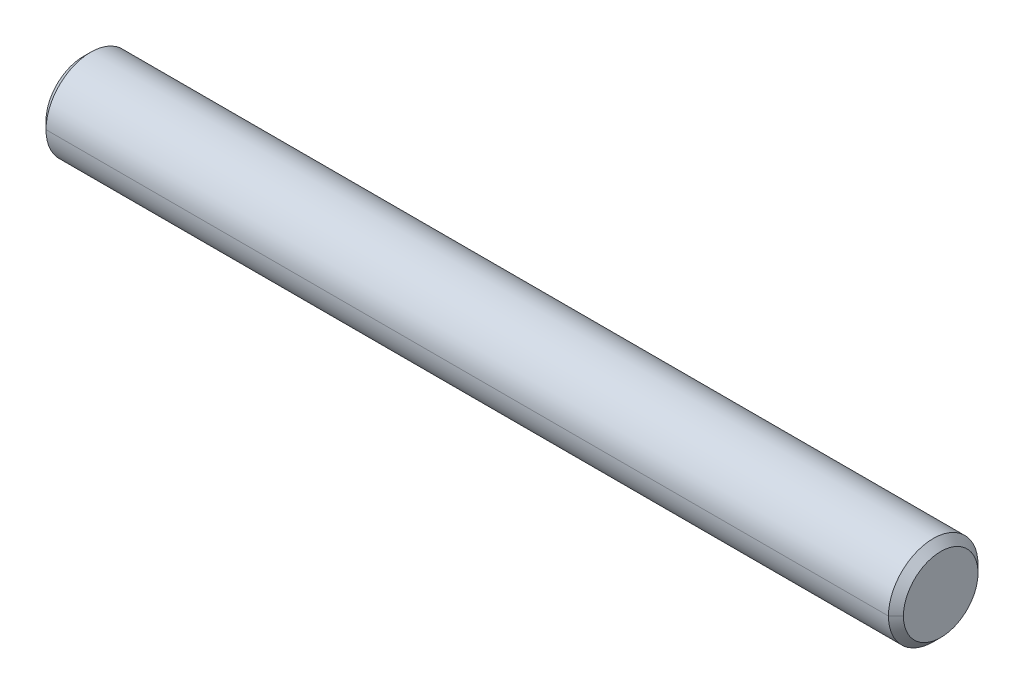
ISO-10303-21;
HEADER;
FILE_DESCRIPTION(('STEP AP214'),'2;1');
FILE_NAME('part.step','',(''),(''),'','','');
FILE_SCHEMA(('AUTOMOTIVE_DESIGN { 1 0 10303 214 1 1 1 1 }'));
ENDSEC;
DATA;
#1=APPLICATION_CONTEXT('core data for automotive mechanical design processes');
#2=APPLICATION_PROTOCOL_DEFINITION('international standard','automotive_design',2000,#1);
#3=PRODUCT_CONTEXT('',#1,'mechanical');
#4=PRODUCT('Part','Part','',(#3));
#5=PRODUCT_RELATED_PRODUCT_CATEGORY('part','',(#4));
#6=PRODUCT_DEFINITION_FORMATION('','',#4);
#7=PRODUCT_DEFINITION_CONTEXT('part definition',#1,'design');
#8=PRODUCT_DEFINITION('design','',#6,#7);
#9=PRODUCT_DEFINITION_SHAPE('','',#8);
#10=(LENGTH_UNIT() NAMED_UNIT(*) SI_UNIT(.MILLI.,.METRE.));
#11=(NAMED_UNIT(*) PLANE_ANGLE_UNIT() SI_UNIT($,.RADIAN.));
#12=(NAMED_UNIT(*) SI_UNIT($,.STERADIAN.) SOLID_ANGLE_UNIT());
#13=UNCERTAINTY_MEASURE_WITH_UNIT(LENGTH_MEASURE(1.E-05),#10,'distance_accuracy_value','');
#14=(GEOMETRIC_REPRESENTATION_CONTEXT(3) GLOBAL_UNCERTAINTY_ASSIGNED_CONTEXT((#13)) GLOBAL_UNIT_ASSIGNED_CONTEXT((#10,
#11,#12)) REPRESENTATION_CONTEXT('',''));
#15=CARTESIAN_POINT('',(0.,0.,0.));
#16=DIRECTION('',(0.,0.,1.));
#17=DIRECTION('',(1.,0.,0.));
#18=AXIS2_PLACEMENT_3D('',#15,#16,#17);
#19=CARTESIAN_POINT('',(28.575,0.,0.));
#20=DIRECTION('',(-1.,0.,0.));
#21=DIRECTION('',(0.,0.,1.));
#22=AXIS2_PLACEMENT_3D('',#19,#20,#21);
#23=CONICAL_SURFACE('',#22,2.4845,0.785398163397443);
#24=DIRECTION('',(-0.707106781186551,0.,-0.707106781186544));
#25=VECTOR('',#24,1.);
#26=CARTESIAN_POINT('',(28.575,0.,-2.4845));
#27=LINE('',#26,#25);
#28=CARTESIAN_POINT('',(28.575,0.,-2.4845));
#29=VERTEX_POINT('',#28);
#30=CARTESIAN_POINT('',(28.075,0.,-2.9845));
#31=VERTEX_POINT('',#30);
#32=EDGE_CURVE('E84',#29,#31,#27,.T.);
#33=ORIENTED_EDGE('',*,*,#32,.F.);
#34=CARTESIAN_POINT('',(28.575,0.,0.));
#35=DIRECTION('',(1.,0.,0.));
#36=DIRECTION('',(0.,0.,-1.));
#37=AXIS2_PLACEMENT_3D('',#34,#35,#36);
#38=CIRCLE('',#37,2.4845);
#39=CARTESIAN_POINT('',(28.575,0.,2.4845));
#40=VERTEX_POINT('',#39);
#41=EDGE_CURVE('E27',#40,#29,#38,.T.);
#42=ORIENTED_EDGE('',*,*,#41,.F.);
#43=DIRECTION('',(-0.707106781186551,0.,0.707106781186544));
#44=VECTOR('',#43,1.);
#45=CARTESIAN_POINT('',(28.575,0.,2.4845));
#46=LINE('',#45,#44);
#47=CARTESIAN_POINT('',(28.075,0.,2.9845));
#48=VERTEX_POINT('',#47);
#49=EDGE_CURVE('E91',#40,#48,#46,.T.);
#50=ORIENTED_EDGE('',*,*,#49,.T.);
#51=CARTESIAN_POINT('',(28.075,0.,0.));
#52=DIRECTION('',(-1.,0.,0.));
#53=DIRECTION('',(0.,0.,-1.));
#54=AXIS2_PLACEMENT_3D('',#51,#52,#53);
#55=CIRCLE('',#54,2.9845);
#56=EDGE_CURVE('E63',#31,#48,#55,.T.);
#57=ORIENTED_EDGE('',*,*,#56,.F.);
#58=EDGE_LOOP('',(#33,#42,#50,#57));
#59=FACE_BOUND('',#58,.T.);
#60=ADVANCED_FACE('F16',(#59),#23,.T.);
#61=CARTESIAN_POINT('',(-28.075,0.,0.));
#62=DIRECTION('',(1.,0.,0.));
#63=DIRECTION('',(0.,0.,-1.));
#64=AXIS2_PLACEMENT_3D('',#61,#62,#63);
#65=CONICAL_SURFACE('',#64,2.9845,0.78539816339746);
#66=DIRECTION('',(0.707106781186539,0.,0.707106781186557));
#67=VECTOR('',#66,1.);
#68=CARTESIAN_POINT('',(-28.075,0.,2.9845));
#69=LINE('',#68,#67);
#70=CARTESIAN_POINT('',(-28.575,0.,2.4845));
#71=VERTEX_POINT('',#70);
#72=CARTESIAN_POINT('',(-28.075,0.,2.9845));
#73=VERTEX_POINT('',#72);
#74=EDGE_CURVE('E112',#71,#73,#69,.T.);
#75=ORIENTED_EDGE('',*,*,#74,.F.);
#76=CARTESIAN_POINT('',(-28.575,0.,0.));
#77=DIRECTION('',(-1.,0.,0.));
#78=DIRECTION('',(0.,0.,-1.));
#79=AXIS2_PLACEMENT_3D('',#76,#77,#78);
#80=CIRCLE('',#79,2.4845);
#81=CARTESIAN_POINT('',(-28.575,0.,-2.4845));
#82=VERTEX_POINT('',#81);
#83=EDGE_CURVE('E11',#82,#71,#80,.T.);
#84=ORIENTED_EDGE('',*,*,#83,.F.);
#85=DIRECTION('',(0.707106781186539,0.,-0.707106781186557));
#86=VECTOR('',#85,1.);
#87=CARTESIAN_POINT('',(-28.075,0.,-2.9845));
#88=LINE('',#87,#86);
#89=CARTESIAN_POINT('',(-28.075,0.,-2.9845));
#90=VERTEX_POINT('',#89);
#91=EDGE_CURVE('E20',#82,#90,#88,.T.);
#92=ORIENTED_EDGE('',*,*,#91,.T.);
#93=CARTESIAN_POINT('',(-28.075,0.,0.));
#94=DIRECTION('',(1.,0.,0.));
#95=DIRECTION('',(0.,0.,-1.));
#96=AXIS2_PLACEMENT_3D('',#93,#94,#95);
#97=CIRCLE('',#96,2.9845);
#98=EDGE_CURVE('E42',#73,#90,#97,.T.);
#99=ORIENTED_EDGE('',*,*,#98,.F.);
#100=EDGE_LOOP('',(#75,#84,#92,#99));
#101=FACE_BOUND('',#100,.T.);
#102=ADVANCED_FACE('F136',(#101),#65,.T.);
#103=CARTESIAN_POINT('',(-28.575,0.,0.));
#104=DIRECTION('',(1.,0.,0.));
#105=DIRECTION('',(0.,1.,0.));
#106=AXIS2_PLACEMENT_3D('',#103,#104,#105);
#107=PLANE('',#106);
#108=ORIENTED_EDGE('',*,*,#83,.T.);
#109=CARTESIAN_POINT('',(-28.575,0.,0.));
#110=DIRECTION('',(-1.,0.,0.));
#111=DIRECTION('',(0.,0.,-1.));
#112=AXIS2_PLACEMENT_3D('',#109,#110,#111);
#113=CIRCLE('',#112,2.4845);
#114=EDGE_CURVE('E107',#71,#82,#113,.T.);
#115=ORIENTED_EDGE('',*,*,#114,.T.);
#116=EDGE_LOOP('',(#108,#115));
#117=FACE_BOUND('',#116,.T.);
#118=ADVANCED_FACE('F141',(#117),#107,.F.);
#119=CARTESIAN_POINT('',(28.575,0.,0.));
#120=DIRECTION('',(1.,0.,0.));
#121=DIRECTION('',(0.,1.,0.));
#122=AXIS2_PLACEMENT_3D('',#119,#120,#121);
#123=PLANE('',#122);
#124=ORIENTED_EDGE('',*,*,#41,.T.);
#125=CARTESIAN_POINT('',(28.575,0.,0.));
#126=DIRECTION('',(1.,0.,0.));
#127=DIRECTION('',(0.,0.,-1.));
#128=AXIS2_PLACEMENT_3D('',#125,#126,#127);
#129=CIRCLE('',#128,2.4845);
#130=EDGE_CURVE('E80',#29,#40,#129,.T.);
#131=ORIENTED_EDGE('',*,*,#130,.T.);
#132=EDGE_LOOP('',(#124,#131));
#133=FACE_BOUND('',#132,.T.);
#134=ADVANCED_FACE('F78',(#133),#123,.T.);
#135=CARTESIAN_POINT('',(28.575,0.,0.));
#136=DIRECTION('',(-1.,0.,0.));
#137=DIRECTION('',(0.,0.,1.));
#138=AXIS2_PLACEMENT_3D('',#135,#136,#137);
#139=CYLINDRICAL_SURFACE('',#138,2.9845);
#140=DIRECTION('',(-1.,0.,0.));
#141=VECTOR('',#140,1.);
#142=CARTESIAN_POINT('',(28.575,0.,-2.9845));
#143=LINE('',#142,#141);
#144=EDGE_CURVE('E101',#31,#90,#143,.T.);
#145=ORIENTED_EDGE('',*,*,#144,.F.);
#146=ORIENTED_EDGE('',*,*,#56,.T.);
#147=DIRECTION('',(-1.,0.,0.));
#148=VECTOR('',#147,1.);
#149=CARTESIAN_POINT('',(28.575,0.,2.9845));
#150=LINE('',#149,#148);
#151=EDGE_CURVE('E104',#48,#73,#150,.T.);
#152=ORIENTED_EDGE('',*,*,#151,.T.);
#153=ORIENTED_EDGE('',*,*,#98,.T.);
#154=EDGE_LOOP('',(#145,#146,#152,#153));
#155=FACE_BOUND('',#154,.T.);
#156=ADVANCED_FACE('F126',(#155),#139,.T.);
#157=CARTESIAN_POINT('',(28.575,0.,0.));
#158=DIRECTION('',(-1.,0.,0.));
#159=DIRECTION('',(0.,0.,1.));
#160=AXIS2_PLACEMENT_3D('',#157,#158,#159);
#161=CYLINDRICAL_SURFACE('',#160,2.9845);
#162=CARTESIAN_POINT('',(28.075,0.,0.));
#163=DIRECTION('',(-1.,0.,0.));
#164=DIRECTION('',(0.,0.,-1.));
#165=AXIS2_PLACEMENT_3D('',#162,#163,#164);
#166=CIRCLE('',#165,2.9845);
#167=EDGE_CURVE('E88',#48,#31,#166,.T.);
#168=ORIENTED_EDGE('',*,*,#167,.T.);
#169=ORIENTED_EDGE('',*,*,#144,.T.);
#170=CARTESIAN_POINT('',(-28.075,0.,0.));
#171=DIRECTION('',(1.,0.,0.));
#172=DIRECTION('',(0.,0.,-1.));
#173=AXIS2_PLACEMENT_3D('',#170,#171,#172);
#174=CIRCLE('',#173,2.9845);
#175=EDGE_CURVE('E108',#90,#73,#174,.T.);
#176=ORIENTED_EDGE('',*,*,#175,.T.);
#177=ORIENTED_EDGE('',*,*,#151,.F.);
#178=EDGE_LOOP('',(#168,#169,#176,#177));
#179=FACE_BOUND('',#178,.T.);
#180=ADVANCED_FACE('F128',(#179),#161,.T.);
#181=CARTESIAN_POINT('',(-28.075,0.,0.));
#182=DIRECTION('',(1.,0.,0.));
#183=DIRECTION('',(0.,0.,-1.));
#184=AXIS2_PLACEMENT_3D('',#181,#182,#183);
#185=CONICAL_SURFACE('',#184,2.9845,0.78539816339746);
#186=ORIENTED_EDGE('',*,*,#114,.F.);
#187=ORIENTED_EDGE('',*,*,#74,.T.);
#188=ORIENTED_EDGE('',*,*,#175,.F.);
#189=ORIENTED_EDGE('',*,*,#91,.F.);
#190=EDGE_LOOP('',(#186,#187,#188,#189));
#191=FACE_BOUND('',#190,.T.);
#192=ADVANCED_FACE('F18',(#191),#185,.T.);
#193=CARTESIAN_POINT('',(28.575,0.,0.));
#194=DIRECTION('',(-1.,0.,0.));
#195=DIRECTION('',(0.,0.,1.));
#196=AXIS2_PLACEMENT_3D('',#193,#194,#195);
#197=CONICAL_SURFACE('',#196,2.4845,0.785398163397443);
#198=ORIENTED_EDGE('',*,*,#130,.F.);
#199=ORIENTED_EDGE('',*,*,#32,.T.);
#200=ORIENTED_EDGE('',*,*,#167,.F.);
#201=ORIENTED_EDGE('',*,*,#49,.F.);
#202=EDGE_LOOP('',(#198,#199,#200,#201));
#203=FACE_BOUND('',#202,.T.);
#204=ADVANCED_FACE('F90',(#203),#197,.T.);
#205=CLOSED_SHELL('',(#60,#102,#118,#134,#156,#180,#192,#204));
#206=MANIFOLD_SOLID_BREP('B1',#205);
#207=ADVANCED_BREP_SHAPE_REPRESENTATION('',(#18,#206),#14);
#208=SHAPE_DEFINITION_REPRESENTATION(#9,#207);
ENDSEC;
END-ISO-10303-21;
